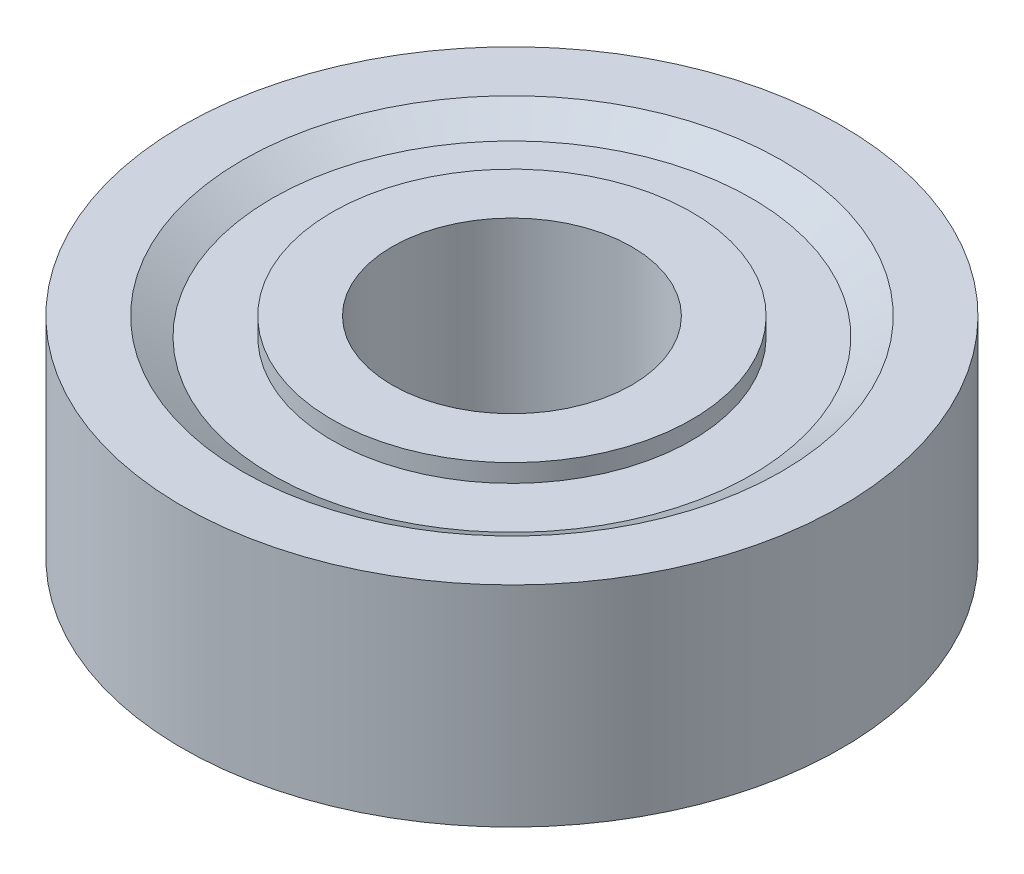
ISO-10303-21;
HEADER;
FILE_DESCRIPTION(('STEP AP214'),'2;1');
FILE_NAME('part.step','',(''),(''),'','','');
FILE_SCHEMA(('AUTOMOTIVE_DESIGN { 1 0 10303 214 1 1 1 1 }'));
ENDSEC;
DATA;
#1=APPLICATION_CONTEXT('core data for automotive mechanical design processes');
#2=APPLICATION_PROTOCOL_DEFINITION('international standard','automotive_design',2000,#1);
#3=PRODUCT_CONTEXT('',#1,'mechanical');
#4=PRODUCT('Part','Part','',(#3));
#5=PRODUCT_RELATED_PRODUCT_CATEGORY('part','',(#4));
#6=PRODUCT_DEFINITION_FORMATION('','',#4);
#7=PRODUCT_DEFINITION_CONTEXT('part definition',#1,'design');
#8=PRODUCT_DEFINITION('design','',#6,#7);
#9=PRODUCT_DEFINITION_SHAPE('','',#8);
#10=(LENGTH_UNIT() NAMED_UNIT(*) SI_UNIT(.MILLI.,.METRE.));
#11=(NAMED_UNIT(*) PLANE_ANGLE_UNIT() SI_UNIT($,.RADIAN.));
#12=(NAMED_UNIT(*) SI_UNIT($,.STERADIAN.) SOLID_ANGLE_UNIT());
#13=UNCERTAINTY_MEASURE_WITH_UNIT(LENGTH_MEASURE(1.E-05),#10,'distance_accuracy_value','');
#14=(GEOMETRIC_REPRESENTATION_CONTEXT(3) GLOBAL_UNCERTAINTY_ASSIGNED_CONTEXT((#13)) GLOBAL_UNIT_ASSIGNED_CONTEXT((#10,
#11,#12)) REPRESENTATION_CONTEXT('',''));
#15=CARTESIAN_POINT('',(0.,0.,0.));
#16=DIRECTION('',(0.,0.,1.));
#17=DIRECTION('',(1.,0.,0.));
#18=AXIS2_PLACEMENT_3D('',#15,#16,#17);
#19=CARTESIAN_POINT('',(4.28004118757508,8.1627429682277,0.));
#20=DIRECTION('',(0.,1.,0.));
#21=DIRECTION('',(-1.,0.,0.));
#22=AXIS2_PLACEMENT_3D('',#19,#20,#21);
#23=CYLINDRICAL_SURFACE('',#22,6.);
#24=CARTESIAN_POINT('',(4.28004118757508,-0.600000000000007,0.));
#25=DIRECTION('',(0.,1.,0.));
#26=DIRECTION('',(-1.,0.,0.));
#27=AXIS2_PLACEMENT_3D('',#24,#25,#26);
#28=CIRCLE('',#27,6.);
#29=CARTESIAN_POINT('',(-1.71995881242492,-0.600000000000008,0.));
#30=VERTEX_POINT('',#29);
#31=EDGE_CURVE('E10',#30,#30,#28,.T.);
#32=ORIENTED_EDGE('',*,*,#31,.T.);
#33=EDGE_LOOP('',(#32));
#34=FACE_BOUND('',#33,.T.);
#35=CARTESIAN_POINT('',(4.28004118757508,0.,0.));
#36=DIRECTION('',(0.,1.,0.));
#37=DIRECTION('',(-1.,0.,0.));
#38=AXIS2_PLACEMENT_3D('',#35,#36,#37);
#39=CIRCLE('',#38,6.);
#40=CARTESIAN_POINT('',(-1.71995881242492,0.,0.));
#41=VERTEX_POINT('',#40);
#42=EDGE_CURVE('E73',#41,#41,#39,.T.);
#43=ORIENTED_EDGE('',*,*,#42,.F.);
#44=EDGE_LOOP('',(#43));
#45=FACE_BOUND('',#44,.T.);
#46=ADVANCED_FACE('F33',(#34,#45),#23,.T.);
#47=CARTESIAN_POINT('',(-1.71995881242492,-0.600000000000009,0.));
#48=DIRECTION('',(0.,-1.,0.));
#49=DIRECTION('',(1.,0.,0.));
#50=AXIS2_PLACEMENT_3D('',#47,#48,#49);
#51=PLANE('',#50);
#52=CARTESIAN_POINT('',(4.28004118757508,-0.600000000000009,0.));
#53=DIRECTION('',(0.,1.,0.));
#54=DIRECTION('',(-1.,0.,0.));
#55=AXIS2_PLACEMENT_3D('',#52,#53,#54);
#56=CIRCLE('',#55,4.);
#57=CARTESIAN_POINT('',(0.280041187575079,-0.600000000000009,0.));
#58=VERTEX_POINT('',#57);
#59=EDGE_CURVE('E39',#58,#58,#56,.T.);
#60=ORIENTED_EDGE('',*,*,#59,.T.);
#61=EDGE_LOOP('',(#60));
#62=FACE_BOUND('',#61,.T.);
#63=ORIENTED_EDGE('',*,*,#31,.F.);
#64=EDGE_LOOP('',(#63));
#65=FACE_BOUND('',#64,.T.);
#66=ADVANCED_FACE('F81',(#62,#65),#51,.T.);
#67=CARTESIAN_POINT('',(4.28004118757508,8.1627429682277,0.));
#68=DIRECTION('',(0.,1.,0.));
#69=DIRECTION('',(-1.,0.,0.));
#70=AXIS2_PLACEMENT_3D('',#67,#68,#69);
#71=CYLINDRICAL_SURFACE('',#70,4.);
#72=CARTESIAN_POINT('',(4.28004118757508,6.4,0.));
#73=DIRECTION('',(0.,1.,0.));
#74=DIRECTION('',(-1.,0.,0.));
#75=AXIS2_PLACEMENT_3D('',#72,#73,#74);
#76=CIRCLE('',#75,4.);
#77=CARTESIAN_POINT('',(0.280041187575079,6.4,0.));
#78=VERTEX_POINT('',#77);
#79=EDGE_CURVE('E43',#78,#78,#76,.T.);
#80=ORIENTED_EDGE('',*,*,#79,.T.);
#81=EDGE_LOOP('',(#80));
#82=FACE_BOUND('',#81,.T.);
#83=ORIENTED_EDGE('',*,*,#59,.F.);
#84=EDGE_LOOP('',(#83));
#85=FACE_BOUND('',#84,.T.);
#86=ADVANCED_FACE('F85',(#82,#85),#71,.F.);
#87=CARTESIAN_POINT('',(-1.71995881242492,6.4,0.));
#88=DIRECTION('',(0.,1.,0.));
#89=DIRECTION('',(-1.,0.,0.));
#90=AXIS2_PLACEMENT_3D('',#87,#88,#89);
#91=PLANE('',#90);
#92=CARTESIAN_POINT('',(4.28004118757508,6.4,0.));
#93=DIRECTION('',(0.,1.,0.));
#94=DIRECTION('',(-1.,0.,0.));
#95=AXIS2_PLACEMENT_3D('',#92,#93,#94);
#96=CIRCLE('',#95,6.);
#97=CARTESIAN_POINT('',(-1.71995881242492,6.4,0.));
#98=VERTEX_POINT('',#97);
#99=EDGE_CURVE('E47',#98,#98,#96,.T.);
#100=ORIENTED_EDGE('',*,*,#99,.T.);
#101=EDGE_LOOP('',(#100));
#102=FACE_BOUND('',#101,.T.);
#103=ORIENTED_EDGE('',*,*,#79,.F.);
#104=EDGE_LOOP('',(#103));
#105=FACE_BOUND('',#104,.T.);
#106=ADVANCED_FACE('F89',(#102,#105),#91,.T.);
#107=CARTESIAN_POINT('',(4.28004118757508,8.1627429682277,0.));
#108=DIRECTION('',(0.,1.,0.));
#109=DIRECTION('',(-1.,0.,0.));
#110=AXIS2_PLACEMENT_3D('',#107,#108,#109);
#111=CYLINDRICAL_SURFACE('',#110,6.);
#112=CARTESIAN_POINT('',(4.28004118757508,5.8,0.));
#113=DIRECTION('',(0.,1.,0.));
#114=DIRECTION('',(-1.,0.,0.));
#115=AXIS2_PLACEMENT_3D('',#112,#113,#114);
#116=CIRCLE('',#115,6.);
#117=CARTESIAN_POINT('',(-1.71995881242492,5.8,0.));
#118=VERTEX_POINT('',#117);
#119=EDGE_CURVE('E52',#118,#118,#116,.T.);
#120=ORIENTED_EDGE('',*,*,#119,.T.);
#121=EDGE_LOOP('',(#120));
#122=FACE_BOUND('',#121,.T.);
#123=ORIENTED_EDGE('',*,*,#99,.F.);
#124=EDGE_LOOP('',(#123));
#125=FACE_BOUND('',#124,.T.);
#126=ADVANCED_FACE('F96',(#122,#125),#111,.T.);
#127=CARTESIAN_POINT('',(-3.71995881242492,5.8,0.));
#128=DIRECTION('',(0.,1.,0.));
#129=DIRECTION('',(-1.,0.,0.));
#130=AXIS2_PLACEMENT_3D('',#127,#128,#129);
#131=PLANE('',#130);
#132=CARTESIAN_POINT('',(4.28004118757508,5.8,0.));
#133=DIRECTION('',(0.,1.,0.));
#134=DIRECTION('',(-1.,0.,0.));
#135=AXIS2_PLACEMENT_3D('',#132,#133,#134);
#136=CIRCLE('',#135,8.);
#137=CARTESIAN_POINT('',(-3.71995881242492,5.8,0.));
#138=VERTEX_POINT('',#137);
#139=EDGE_CURVE('E55',#138,#138,#136,.T.);
#140=ORIENTED_EDGE('',*,*,#139,.T.);
#141=EDGE_LOOP('',(#140));
#142=FACE_BOUND('',#141,.T.);
#143=ORIENTED_EDGE('',*,*,#119,.F.);
#144=EDGE_LOOP('',(#143));
#145=FACE_BOUND('',#144,.T.);
#146=ADVANCED_FACE('F100',(#142,#145),#131,.T.);
#147=CARTESIAN_POINT('',(4.28004118757508,5.8,0.));
#148=DIRECTION('',(0.,1.,0.));
#149=DIRECTION('',(-1.,0.,0.));
#150=AXIS2_PLACEMENT_3D('',#147,#148,#149);
#151=CONICAL_SURFACE('',#150,8.,1.03037682652431);
#152=CARTESIAN_POINT('',(4.28004118757508,6.4,0.));
#153=DIRECTION('',(0.,1.,0.));
#154=DIRECTION('',(-1.,0.,0.));
#155=AXIS2_PLACEMENT_3D('',#152,#153,#154);
#156=CIRCLE('',#155,9.);
#157=CARTESIAN_POINT('',(-4.71995881242492,6.4,0.));
#158=VERTEX_POINT('',#157);
#159=EDGE_CURVE('E58',#158,#158,#156,.T.);
#160=ORIENTED_EDGE('',*,*,#159,.T.);
#161=EDGE_LOOP('',(#160));
#162=FACE_BOUND('',#161,.T.);
#163=ORIENTED_EDGE('',*,*,#139,.F.);
#164=EDGE_LOOP('',(#163));
#165=FACE_BOUND('',#164,.T.);
#166=ADVANCED_FACE('F104',(#162,#165),#151,.F.);
#167=CARTESIAN_POINT('',(-6.71995881242492,6.4,0.));
#168=DIRECTION('',(0.,1.,0.));
#169=DIRECTION('',(-1.,0.,0.));
#170=AXIS2_PLACEMENT_3D('',#167,#168,#169);
#171=PLANE('',#170);
#172=CARTESIAN_POINT('',(4.28004118757508,6.4,0.));
#173=DIRECTION('',(0.,1.,0.));
#174=DIRECTION('',(-1.,0.,0.));
#175=AXIS2_PLACEMENT_3D('',#172,#173,#174);
#176=CIRCLE('',#175,11.);
#177=CARTESIAN_POINT('',(-6.71995881242492,6.4,0.));
#178=VERTEX_POINT('',#177);
#179=EDGE_CURVE('E61',#178,#178,#176,.T.);
#180=ORIENTED_EDGE('',*,*,#179,.T.);
#181=EDGE_LOOP('',(#180));
#182=FACE_BOUND('',#181,.T.);
#183=ORIENTED_EDGE('',*,*,#159,.F.);
#184=EDGE_LOOP('',(#183));
#185=FACE_BOUND('',#184,.T.);
#186=ADVANCED_FACE('F108',(#182,#185),#171,.T.);
#187=CARTESIAN_POINT('',(4.28004118757508,8.1627429682277,0.));
#188=DIRECTION('',(0.,1.,0.));
#189=DIRECTION('',(-1.,0.,0.));
#190=AXIS2_PLACEMENT_3D('',#187,#188,#189);
#191=CYLINDRICAL_SURFACE('',#190,11.);
#192=CARTESIAN_POINT('',(4.28004118757508,-0.6,0.));
#193=DIRECTION('',(0.,1.,0.));
#194=DIRECTION('',(-1.,0.,0.));
#195=AXIS2_PLACEMENT_3D('',#192,#193,#194);
#196=CIRCLE('',#195,11.);
#197=CARTESIAN_POINT('',(-6.71995881242492,-0.600000000000002,0.));
#198=VERTEX_POINT('',#197);
#199=EDGE_CURVE('E64',#198,#198,#196,.T.);
#200=ORIENTED_EDGE('',*,*,#199,.T.);
#201=EDGE_LOOP('',(#200));
#202=FACE_BOUND('',#201,.T.);
#203=ORIENTED_EDGE('',*,*,#179,.F.);
#204=EDGE_LOOP('',(#203));
#205=FACE_BOUND('',#204,.T.);
#206=ADVANCED_FACE('F112',(#202,#205),#191,.T.);
#207=CARTESIAN_POINT('',(-4.71995881242492,-0.600000000000001,0.));
#208=DIRECTION('',(0.,-1.,0.));
#209=DIRECTION('',(1.,0.,0.));
#210=AXIS2_PLACEMENT_3D('',#207,#208,#209);
#211=PLANE('',#210);
#212=CARTESIAN_POINT('',(4.28004118757508,-0.6,0.));
#213=DIRECTION('',(0.,1.,0.));
#214=DIRECTION('',(-1.,0.,0.));
#215=AXIS2_PLACEMENT_3D('',#212,#213,#214);
#216=CIRCLE('',#215,9.);
#217=CARTESIAN_POINT('',(-4.71995881242492,-0.600000000000001,0.));
#218=VERTEX_POINT('',#217);
#219=EDGE_CURVE('E67',#218,#218,#216,.T.);
#220=ORIENTED_EDGE('',*,*,#219,.T.);
#221=EDGE_LOOP('',(#220));
#222=FACE_BOUND('',#221,.T.);
#223=ORIENTED_EDGE('',*,*,#199,.F.);
#224=EDGE_LOOP('',(#223));
#225=FACE_BOUND('',#224,.T.);
#226=ADVANCED_FACE('F116',(#222,#225),#211,.T.);
#227=CARTESIAN_POINT('',(4.28004118757508,-0.6,0.));
#228=DIRECTION('',(0.,-1.,0.));
#229=DIRECTION('',(1.,0.,0.));
#230=AXIS2_PLACEMENT_3D('',#227,#228,#229);
#231=CONICAL_SURFACE('',#230,9.,1.03037682652431);
#232=CARTESIAN_POINT('',(4.28004118757508,0.,0.));
#233=DIRECTION('',(0.,1.,0.));
#234=DIRECTION('',(-1.,0.,0.));
#235=AXIS2_PLACEMENT_3D('',#232,#233,#234);
#236=CIRCLE('',#235,8.);
#237=CARTESIAN_POINT('',(-3.71995881242492,0.,0.));
#238=VERTEX_POINT('',#237);
#239=EDGE_CURVE('E70',#238,#238,#236,.T.);
#240=ORIENTED_EDGE('',*,*,#239,.T.);
#241=EDGE_LOOP('',(#240));
#242=FACE_BOUND('',#241,.T.);
#243=ORIENTED_EDGE('',*,*,#219,.F.);
#244=EDGE_LOOP('',(#243));
#245=FACE_BOUND('',#244,.T.);
#246=ADVANCED_FACE('F120',(#242,#245),#231,.F.);
#247=CARTESIAN_POINT('',(-3.71995881242492,0.,0.));
#248=DIRECTION('',(0.,-1.,0.));
#249=DIRECTION('',(1.,0.,0.));
#250=AXIS2_PLACEMENT_3D('',#247,#248,#249);
#251=PLANE('',#250);
#252=ORIENTED_EDGE('',*,*,#42,.T.);
#253=EDGE_LOOP('',(#252));
#254=FACE_BOUND('',#253,.T.);
#255=ORIENTED_EDGE('',*,*,#239,.F.);
#256=EDGE_LOOP('',(#255));
#257=FACE_BOUND('',#256,.T.);
#258=ADVANCED_FACE('F77',(#254,#257),#251,.T.);
#259=CLOSED_SHELL('',(#46,#66,#86,#106,#126,#146,#166,#186,#206,#226,#246,#258));
#260=MANIFOLD_SOLID_BREP('B2',#259);
#261=ADVANCED_BREP_SHAPE_REPRESENTATION('',(#18,#260),#14);
#262=SHAPE_DEFINITION_REPRESENTATION(#9,#261);
ENDSEC;
END-ISO-10303-21;
